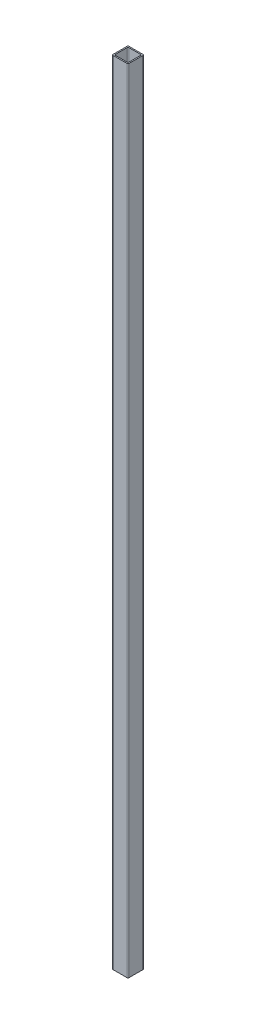
ISO-10303-21;
HEADER;
FILE_DESCRIPTION(('STEP AP214'),'2;1');
FILE_NAME('part.step','',(''),(''),'','','');
FILE_SCHEMA(('AUTOMOTIVE_DESIGN { 1 0 10303 214 1 1 1 1 }'));
ENDSEC;
DATA;
#1=APPLICATION_CONTEXT('core data for automotive mechanical design processes');
#2=APPLICATION_PROTOCOL_DEFINITION('international standard','automotive_design',2000,#1);
#3=PRODUCT_CONTEXT('',#1,'mechanical');
#4=PRODUCT('Part','Part','',(#3));
#5=PRODUCT_RELATED_PRODUCT_CATEGORY('part','',(#4));
#6=PRODUCT_DEFINITION_FORMATION('','',#4);
#7=PRODUCT_DEFINITION_CONTEXT('part definition',#1,'design');
#8=PRODUCT_DEFINITION('design','',#6,#7);
#9=PRODUCT_DEFINITION_SHAPE('','',#8);
#10=(LENGTH_UNIT() NAMED_UNIT(*) SI_UNIT(.MILLI.,.METRE.));
#11=(NAMED_UNIT(*) PLANE_ANGLE_UNIT() SI_UNIT($,.RADIAN.));
#12=(NAMED_UNIT(*) SI_UNIT($,.STERADIAN.) SOLID_ANGLE_UNIT());
#13=UNCERTAINTY_MEASURE_WITH_UNIT(LENGTH_MEASURE(1.E-05),#10,'distance_accuracy_value','');
#14=(GEOMETRIC_REPRESENTATION_CONTEXT(3) GLOBAL_UNCERTAINTY_ASSIGNED_CONTEXT((#13)) GLOBAL_UNIT_ASSIGNED_CONTEXT((#10,
#11,#12)) REPRESENTATION_CONTEXT('',''));
#15=CARTESIAN_POINT('',(0.,0.,0.));
#16=DIRECTION('',(0.,0.,1.));
#17=DIRECTION('',(1.,0.,0.));
#18=AXIS2_PLACEMENT_3D('',#15,#16,#17);
#19=CARTESIAN_POINT('',(-9.,1000.,9.));
#20=DIRECTION('',(0.,-1.,0.));
#21=DIRECTION('',(0.,0.,-1.));
#22=AXIS2_PLACEMENT_3D('',#19,#20,#21);
#23=PLANE('',#22);
#24=CARTESIAN_POINT('',(-9.,1000.,9.));
#25=DIRECTION('',(0.,1.,0.));
#26=DIRECTION('',(0.,0.,-1.));
#27=AXIS2_PLACEMENT_3D('',#24,#25,#26);
#28=CIRCLE('',#27,0.999999999999999);
#29=CARTESIAN_POINT('',(-10.,1000.,8.99999999999999));
#30=VERTEX_POINT('',#29);
#31=CARTESIAN_POINT('',(-8.99999999999999,1000.,10.));
#32=VERTEX_POINT('',#31);
#33=EDGE_CURVE('E216',#30,#32,#28,.T.);
#34=ORIENTED_EDGE('',*,*,#33,.T.);
#35=DIRECTION('',(1.,0.,0.));
#36=VECTOR('',#35,1.);
#37=CARTESIAN_POINT('',(-8.99999999999999,1000.,10.));
#38=LINE('',#37,#36);
#39=CARTESIAN_POINT('',(8.99999999999999,1000.,10.));
#40=VERTEX_POINT('',#39);
#41=EDGE_CURVE('E219',#32,#40,#38,.T.);
#42=ORIENTED_EDGE('',*,*,#41,.T.);
#43=CARTESIAN_POINT('',(9.,1000.,9.));
#44=DIRECTION('',(0.,1.,0.));
#45=DIRECTION('',(0.,0.,1.));
#46=AXIS2_PLACEMENT_3D('',#43,#44,#45);
#47=CIRCLE('',#46,0.999999999999999);
#48=CARTESIAN_POINT('',(10.,1000.,8.99999999999999));
#49=VERTEX_POINT('',#48);
#50=EDGE_CURVE('E222',#40,#49,#47,.T.);
#51=ORIENTED_EDGE('',*,*,#50,.T.);
#52=DIRECTION('',(0.,0.,-1.));
#53=VECTOR('',#52,1.);
#54=CARTESIAN_POINT('',(10.,1000.,8.99999999999999));
#55=LINE('',#54,#53);
#56=CARTESIAN_POINT('',(10.,1000.,-8.99999999999999));
#57=VERTEX_POINT('',#56);
#58=EDGE_CURVE('E224',#49,#57,#55,.T.);
#59=ORIENTED_EDGE('',*,*,#58,.T.);
#60=CARTESIAN_POINT('',(9.,1000.,-9.));
#61=DIRECTION('',(0.,1.,0.));
#62=DIRECTION('',(0.,0.,-1.));
#63=AXIS2_PLACEMENT_3D('',#60,#61,#62);
#64=CIRCLE('',#63,0.999999999999999);
#65=CARTESIAN_POINT('',(8.99999999999999,1000.,-10.));
#66=VERTEX_POINT('',#65);
#67=EDGE_CURVE('E226',#57,#66,#64,.T.);
#68=ORIENTED_EDGE('',*,*,#67,.T.);
#69=DIRECTION('',(-1.,0.,0.));
#70=VECTOR('',#69,1.);
#71=CARTESIAN_POINT('',(-8.99999999999999,1000.,-10.));
#72=LINE('',#71,#70);
#73=CARTESIAN_POINT('',(-8.99999999999999,1000.,-10.));
#74=VERTEX_POINT('',#73);
#75=EDGE_CURVE('E228',#66,#74,#72,.T.);
#76=ORIENTED_EDGE('',*,*,#75,.T.);
#77=CARTESIAN_POINT('',(-9.,1000.,-9.));
#78=DIRECTION('',(0.,1.,0.));
#79=DIRECTION('',(0.,0.,-1.));
#80=AXIS2_PLACEMENT_3D('',#77,#78,#79);
#81=CIRCLE('',#80,0.999999999999999);
#82=CARTESIAN_POINT('',(-10.,1000.,-8.99999999999999));
#83=VERTEX_POINT('',#82);
#84=EDGE_CURVE('E230',#74,#83,#81,.T.);
#85=ORIENTED_EDGE('',*,*,#84,.T.);
#86=DIRECTION('',(0.,0.,1.));
#87=VECTOR('',#86,1.);
#88=CARTESIAN_POINT('',(-10.,1000.,8.99999999999999));
#89=LINE('',#88,#87);
#90=EDGE_CURVE('E232',#83,#30,#89,.T.);
#91=ORIENTED_EDGE('',*,*,#90,.T.);
#92=EDGE_LOOP('',(#34,#42,#51,#59,#68,#76,#85,#91));
#93=FACE_BOUND('',#92,.T.);
#94=CARTESIAN_POINT('',(-7.5,1000.,7.5));
#95=DIRECTION('',(0.,1.,0.));
#96=DIRECTION('',(0.,0.,-1.));
#97=AXIS2_PLACEMENT_3D('',#94,#95,#96);
#98=CIRCLE('',#97,1.);
#99=CARTESIAN_POINT('',(-8.5,1000.,7.49999999999999));
#100=VERTEX_POINT('',#99);
#101=CARTESIAN_POINT('',(-7.5,1000.,8.5));
#102=VERTEX_POINT('',#101);
#103=EDGE_CURVE('E151',#100,#102,#98,.T.);
#104=ORIENTED_EDGE('',*,*,#103,.F.);
#105=DIRECTION('',(0.,0.,1.));
#106=VECTOR('',#105,1.);
#107=CARTESIAN_POINT('',(-8.5,1000.,7.49999999999999));
#108=LINE('',#107,#106);
#109=CARTESIAN_POINT('',(-8.5,1000.,-7.49999999999999));
#110=VERTEX_POINT('',#109);
#111=EDGE_CURVE('E184',#110,#100,#108,.T.);
#112=ORIENTED_EDGE('',*,*,#111,.F.);
#113=CARTESIAN_POINT('',(-7.5,1000.,-7.5));
#114=DIRECTION('',(0.,1.,0.));
#115=DIRECTION('',(0.,0.,-1.));
#116=AXIS2_PLACEMENT_3D('',#113,#114,#115);
#117=CIRCLE('',#116,1.);
#118=CARTESIAN_POINT('',(-7.5,1000.,-8.5));
#119=VERTEX_POINT('',#118);
#120=EDGE_CURVE('E182',#119,#110,#117,.T.);
#121=ORIENTED_EDGE('',*,*,#120,.F.);
#122=DIRECTION('',(-1.,0.,0.));
#123=VECTOR('',#122,1.);
#124=CARTESIAN_POINT('',(-7.5,1000.,-8.5));
#125=LINE('',#124,#123);
#126=CARTESIAN_POINT('',(7.49999999999999,1000.,-8.5));
#127=VERTEX_POINT('',#126);
#128=EDGE_CURVE('E180',#127,#119,#125,.T.);
#129=ORIENTED_EDGE('',*,*,#128,.F.);
#130=CARTESIAN_POINT('',(7.5,1000.,-7.5));
#131=DIRECTION('',(0.,1.,0.));
#132=DIRECTION('',(0.,0.,-1.));
#133=AXIS2_PLACEMENT_3D('',#130,#131,#132);
#134=CIRCLE('',#133,1.);
#135=CARTESIAN_POINT('',(8.5,1000.,-7.49999999999999));
#136=VERTEX_POINT('',#135);
#137=EDGE_CURVE('E178',#136,#127,#134,.T.);
#138=ORIENTED_EDGE('',*,*,#137,.F.);
#139=DIRECTION('',(0.,0.,-1.));
#140=VECTOR('',#139,1.);
#141=CARTESIAN_POINT('',(8.5,1000.,7.49999999999999));
#142=LINE('',#141,#140);
#143=CARTESIAN_POINT('',(8.5,1000.,7.49999999999999));
#144=VERTEX_POINT('',#143);
#145=EDGE_CURVE('E174',#144,#136,#142,.T.);
#146=ORIENTED_EDGE('',*,*,#145,.F.);
#147=CARTESIAN_POINT('',(7.5,1000.,7.5));
#148=DIRECTION('',(0.,1.,0.));
#149=DIRECTION('',(0.,0.,1.));
#150=AXIS2_PLACEMENT_3D('',#147,#148,#149);
#151=CIRCLE('',#150,1.);
#152=CARTESIAN_POINT('',(7.49999999999999,1000.,8.5));
#153=VERTEX_POINT('',#152);
#154=EDGE_CURVE('E172',#153,#144,#151,.T.);
#155=ORIENTED_EDGE('',*,*,#154,.F.);
#156=DIRECTION('',(1.,0.,0.));
#157=VECTOR('',#156,1.);
#158=CARTESIAN_POINT('',(-7.5,1000.,8.5));
#159=LINE('',#158,#157);
#160=EDGE_CURVE('E159',#102,#153,#159,.T.);
#161=ORIENTED_EDGE('',*,*,#160,.F.);
#162=EDGE_LOOP('',(#104,#112,#121,#129,#138,#146,#155,#161));
#163=FACE_BOUND('',#162,.T.);
#164=ADVANCED_FACE('F38',(#93,#163),#23,.F.);
#165=CARTESIAN_POINT('',(-9.,0.,9.));
#166=DIRECTION('',(0.,-1.,0.));
#167=DIRECTION('',(0.,0.,-1.));
#168=AXIS2_PLACEMENT_3D('',#165,#166,#167);
#169=PLANE('',#168);
#170=CARTESIAN_POINT('',(-9.,0.,9.));
#171=DIRECTION('',(0.,1.,0.));
#172=DIRECTION('',(0.,0.,-1.));
#173=AXIS2_PLACEMENT_3D('',#170,#171,#172);
#174=CIRCLE('',#173,0.999999999999999);
#175=CARTESIAN_POINT('',(-10.,0.,8.99999999999999));
#176=VERTEX_POINT('',#175);
#177=CARTESIAN_POINT('',(-8.99999999999999,0.,10.));
#178=VERTEX_POINT('',#177);
#179=EDGE_CURVE('E167',#176,#178,#174,.T.);
#180=ORIENTED_EDGE('',*,*,#179,.F.);
#181=DIRECTION('',(0.,0.,1.));
#182=VECTOR('',#181,1.);
#183=CARTESIAN_POINT('',(-10.,0.,8.99999999999999));
#184=LINE('',#183,#182);
#185=CARTESIAN_POINT('',(-10.,0.,-8.99999999999999));
#186=VERTEX_POINT('',#185);
#187=EDGE_CURVE('E220',#186,#176,#184,.T.);
#188=ORIENTED_EDGE('',*,*,#187,.F.);
#189=CARTESIAN_POINT('',(-9.,0.,-9.));
#190=DIRECTION('',(0.,1.,0.));
#191=DIRECTION('',(0.,0.,-1.));
#192=AXIS2_PLACEMENT_3D('',#189,#190,#191);
#193=CIRCLE('',#192,0.999999999999999);
#194=CARTESIAN_POINT('',(-8.99999999999999,0.,-10.));
#195=VERTEX_POINT('',#194);
#196=EDGE_CURVE('E247',#195,#186,#193,.T.);
#197=ORIENTED_EDGE('',*,*,#196,.F.);
#198=DIRECTION('',(-1.,0.,0.));
#199=VECTOR('',#198,1.);
#200=CARTESIAN_POINT('',(-8.99999999999999,0.,-10.));
#201=LINE('',#200,#199);
#202=CARTESIAN_POINT('',(8.99999999999999,0.,-10.));
#203=VERTEX_POINT('',#202);
#204=EDGE_CURVE('E245',#203,#195,#201,.T.);
#205=ORIENTED_EDGE('',*,*,#204,.F.);
#206=CARTESIAN_POINT('',(9.,0.,-9.));
#207=DIRECTION('',(0.,1.,0.));
#208=DIRECTION('',(0.,0.,-1.));
#209=AXIS2_PLACEMENT_3D('',#206,#207,#208);
#210=CIRCLE('',#209,0.999999999999999);
#211=CARTESIAN_POINT('',(10.,0.,-8.99999999999999));
#212=VERTEX_POINT('',#211);
#213=EDGE_CURVE('E243',#212,#203,#210,.T.);
#214=ORIENTED_EDGE('',*,*,#213,.F.);
#215=DIRECTION('',(0.,0.,-1.));
#216=VECTOR('',#215,1.);
#217=CARTESIAN_POINT('',(10.,0.,8.99999999999999));
#218=LINE('',#217,#216);
#219=CARTESIAN_POINT('',(10.,0.,8.99999999999999));
#220=VERTEX_POINT('',#219);
#221=EDGE_CURVE('E241',#220,#212,#218,.T.);
#222=ORIENTED_EDGE('',*,*,#221,.F.);
#223=CARTESIAN_POINT('',(9.,0.,9.));
#224=DIRECTION('',(0.,1.,0.));
#225=DIRECTION('',(0.,0.,1.));
#226=AXIS2_PLACEMENT_3D('',#223,#224,#225);
#227=CIRCLE('',#226,0.999999999999999);
#228=CARTESIAN_POINT('',(8.99999999999999,0.,10.));
#229=VERTEX_POINT('',#228);
#230=EDGE_CURVE('E239',#229,#220,#227,.T.);
#231=ORIENTED_EDGE('',*,*,#230,.F.);
#232=DIRECTION('',(1.,0.,0.));
#233=VECTOR('',#232,1.);
#234=CARTESIAN_POINT('',(-8.99999999999999,0.,10.));
#235=LINE('',#234,#233);
#236=EDGE_CURVE('E237',#178,#229,#235,.T.);
#237=ORIENTED_EDGE('',*,*,#236,.F.);
#238=EDGE_LOOP('',(#180,#188,#197,#205,#214,#222,#231,#237));
#239=FACE_BOUND('',#238,.T.);
#240=DIRECTION('',(0.,0.,1.));
#241=VECTOR('',#240,1.);
#242=CARTESIAN_POINT('',(-8.5,0.,7.49999999999999));
#243=LINE('',#242,#241);
#244=CARTESIAN_POINT('',(-8.5,0.,-7.49999999999999));
#245=VERTEX_POINT('',#244);
#246=CARTESIAN_POINT('',(-8.5,0.,7.49999999999999));
#247=VERTEX_POINT('',#246);
#248=EDGE_CURVE('E160',#245,#247,#243,.T.);
#249=ORIENTED_EDGE('',*,*,#248,.T.);
#250=CARTESIAN_POINT('',(-7.5,0.,7.5));
#251=DIRECTION('',(0.,1.,0.));
#252=DIRECTION('',(0.,0.,-1.));
#253=AXIS2_PLACEMENT_3D('',#250,#251,#252);
#254=CIRCLE('',#253,1.);
#255=CARTESIAN_POINT('',(-7.5,0.,8.5));
#256=VERTEX_POINT('',#255);
#257=EDGE_CURVE('E61',#247,#256,#254,.T.);
#258=ORIENTED_EDGE('',*,*,#257,.T.);
#259=DIRECTION('',(1.,0.,0.));
#260=VECTOR('',#259,1.);
#261=CARTESIAN_POINT('',(-7.5,0.,8.5));
#262=LINE('',#261,#260);
#263=CARTESIAN_POINT('',(7.49999999999999,0.,8.5));
#264=VERTEX_POINT('',#263);
#265=EDGE_CURVE('E166',#256,#264,#262,.T.);
#266=ORIENTED_EDGE('',*,*,#265,.T.);
#267=CARTESIAN_POINT('',(7.5,0.,7.5));
#268=DIRECTION('',(0.,1.,0.));
#269=DIRECTION('',(0.,0.,1.));
#270=AXIS2_PLACEMENT_3D('',#267,#268,#269);
#271=CIRCLE('',#270,1.);
#272=CARTESIAN_POINT('',(8.5,0.,7.49999999999999));
#273=VERTEX_POINT('',#272);
#274=EDGE_CURVE('E188',#264,#273,#271,.T.);
#275=ORIENTED_EDGE('',*,*,#274,.T.);
#276=DIRECTION('',(0.,0.,-1.));
#277=VECTOR('',#276,1.);
#278=CARTESIAN_POINT('',(8.5,0.,7.49999999999999));
#279=LINE('',#278,#277);
#280=CARTESIAN_POINT('',(8.5,0.,-7.49999999999999));
#281=VERTEX_POINT('',#280);
#282=EDGE_CURVE('E191',#273,#281,#279,.T.);
#283=ORIENTED_EDGE('',*,*,#282,.T.);
#284=CARTESIAN_POINT('',(7.5,0.,-7.5));
#285=DIRECTION('',(0.,1.,0.));
#286=DIRECTION('',(0.,0.,-1.));
#287=AXIS2_PLACEMENT_3D('',#284,#285,#286);
#288=CIRCLE('',#287,1.);
#289=CARTESIAN_POINT('',(7.49999999999999,0.,-8.5));
#290=VERTEX_POINT('',#289);
#291=EDGE_CURVE('E194',#281,#290,#288,.T.);
#292=ORIENTED_EDGE('',*,*,#291,.T.);
#293=DIRECTION('',(-1.,0.,0.));
#294=VECTOR('',#293,1.);
#295=CARTESIAN_POINT('',(-7.5,0.,-8.5));
#296=LINE('',#295,#294);
#297=CARTESIAN_POINT('',(-7.5,0.,-8.5));
#298=VERTEX_POINT('',#297);
#299=EDGE_CURVE('E197',#290,#298,#296,.T.);
#300=ORIENTED_EDGE('',*,*,#299,.T.);
#301=CARTESIAN_POINT('',(-7.5,0.,-7.5));
#302=DIRECTION('',(0.,1.,0.));
#303=DIRECTION('',(0.,0.,-1.));
#304=AXIS2_PLACEMENT_3D('',#301,#302,#303);
#305=CIRCLE('',#304,1.);
#306=EDGE_CURVE('E200',#298,#245,#305,.T.);
#307=ORIENTED_EDGE('',*,*,#306,.T.);
#308=EDGE_LOOP('',(#249,#258,#266,#275,#283,#292,#300,#307));
#309=FACE_BOUND('',#308,.T.);
#310=ADVANCED_FACE('F277',(#239,#309),#169,.T.);
#311=CARTESIAN_POINT('',(-9.,1000.,9.));
#312=DIRECTION('',(0.,-1.,0.));
#313=DIRECTION('',(0.,0.,-1.));
#314=AXIS2_PLACEMENT_3D('',#311,#312,#313);
#315=CYLINDRICAL_SURFACE('',#314,0.999999999999999);
#316=ORIENTED_EDGE('',*,*,#179,.T.);
#317=DIRECTION('',(0.,-1.,0.));
#318=VECTOR('',#317,1.);
#319=CARTESIAN_POINT('',(-8.99999999999999,1000.,10.));
#320=LINE('',#319,#318);
#321=EDGE_CURVE('E11',#32,#178,#320,.T.);
#322=ORIENTED_EDGE('',*,*,#321,.F.);
#323=ORIENTED_EDGE('',*,*,#33,.F.);
#324=DIRECTION('',(0.,-1.,0.));
#325=VECTOR('',#324,1.);
#326=CARTESIAN_POINT('',(-10.,1000.,8.99999999999999));
#327=LINE('',#326,#325);
#328=EDGE_CURVE('E234',#30,#176,#327,.T.);
#329=ORIENTED_EDGE('',*,*,#328,.T.);
#330=EDGE_LOOP('',(#316,#322,#323,#329));
#331=FACE_BOUND('',#330,.T.);
#332=ADVANCED_FACE('F40',(#331),#315,.T.);
#333=CARTESIAN_POINT('',(-8.99999999999999,1000.,10.));
#334=DIRECTION('',(0.,0.,-1.));
#335=DIRECTION('',(-1.,0.,0.));
#336=AXIS2_PLACEMENT_3D('',#333,#334,#335);
#337=PLANE('',#336);
#338=ORIENTED_EDGE('',*,*,#236,.T.);
#339=DIRECTION('',(0.,-1.,0.));
#340=VECTOR('',#339,1.);
#341=CARTESIAN_POINT('',(8.99999999999999,1000.,10.));
#342=LINE('',#341,#340);
#343=EDGE_CURVE('E46',#40,#229,#342,.T.);
#344=ORIENTED_EDGE('',*,*,#343,.F.);
#345=ORIENTED_EDGE('',*,*,#41,.F.);
#346=ORIENTED_EDGE('',*,*,#321,.T.);
#347=EDGE_LOOP('',(#338,#344,#345,#346));
#348=FACE_BOUND('',#347,.T.);
#349=ADVANCED_FACE('F294',(#348),#337,.F.);
#350=CARTESIAN_POINT('',(9.,1000.,9.));
#351=DIRECTION('',(0.,-1.,0.));
#352=DIRECTION('',(0.,0.,-1.));
#353=AXIS2_PLACEMENT_3D('',#350,#351,#352);
#354=CYLINDRICAL_SURFACE('',#353,0.999999999999999);
#355=ORIENTED_EDGE('',*,*,#230,.T.);
#356=DIRECTION('',(0.,-1.,0.));
#357=VECTOR('',#356,1.);
#358=CARTESIAN_POINT('',(10.,1000.,8.99999999999999));
#359=LINE('',#358,#357);
#360=EDGE_CURVE('E264',#49,#220,#359,.T.);
#361=ORIENTED_EDGE('',*,*,#360,.F.);
#362=ORIENTED_EDGE('',*,*,#50,.F.);
#363=ORIENTED_EDGE('',*,*,#343,.T.);
#364=EDGE_LOOP('',(#355,#361,#362,#363));
#365=FACE_BOUND('',#364,.T.);
#366=ADVANCED_FACE('F271',(#365),#354,.T.);
#367=CARTESIAN_POINT('',(10.,1000.,8.99999999999999));
#368=DIRECTION('',(-1.,0.,0.));
#369=DIRECTION('',(0.,0.,1.));
#370=AXIS2_PLACEMENT_3D('',#367,#368,#369);
#371=PLANE('',#370);
#372=ORIENTED_EDGE('',*,*,#221,.T.);
#373=DIRECTION('',(0.,-1.,0.));
#374=VECTOR('',#373,1.);
#375=CARTESIAN_POINT('',(10.,1000.,-8.99999999999999));
#376=LINE('',#375,#374);
#377=EDGE_CURVE('E261',#57,#212,#376,.T.);
#378=ORIENTED_EDGE('',*,*,#377,.F.);
#379=ORIENTED_EDGE('',*,*,#58,.F.);
#380=ORIENTED_EDGE('',*,*,#360,.T.);
#381=EDGE_LOOP('',(#372,#378,#379,#380));
#382=FACE_BOUND('',#381,.T.);
#383=ADVANCED_FACE('F283',(#382),#371,.F.);
#384=CARTESIAN_POINT('',(9.,1000.,-9.));
#385=DIRECTION('',(0.,-1.,0.));
#386=DIRECTION('',(0.,0.,-1.));
#387=AXIS2_PLACEMENT_3D('',#384,#385,#386);
#388=CYLINDRICAL_SURFACE('',#387,0.999999999999999);
#389=ORIENTED_EDGE('',*,*,#213,.T.);
#390=DIRECTION('',(0.,-1.,0.));
#391=VECTOR('',#390,1.);
#392=CARTESIAN_POINT('',(8.99999999999999,1000.,-10.));
#393=LINE('',#392,#391);
#394=EDGE_CURVE('E258',#66,#203,#393,.T.);
#395=ORIENTED_EDGE('',*,*,#394,.F.);
#396=ORIENTED_EDGE('',*,*,#67,.F.);
#397=ORIENTED_EDGE('',*,*,#377,.T.);
#398=EDGE_LOOP('',(#389,#395,#396,#397));
#399=FACE_BOUND('',#398,.T.);
#400=ADVANCED_FACE('F287',(#399),#388,.T.);
#401=CARTESIAN_POINT('',(-8.99999999999999,1000.,-10.));
#402=DIRECTION('',(0.,0.,1.));
#403=DIRECTION('',(1.,0.,0.));
#404=AXIS2_PLACEMENT_3D('',#401,#402,#403);
#405=PLANE('',#404);
#406=ORIENTED_EDGE('',*,*,#204,.T.);
#407=DIRECTION('',(0.,-1.,0.));
#408=VECTOR('',#407,1.);
#409=CARTESIAN_POINT('',(-8.99999999999999,1000.,-10.));
#410=LINE('',#409,#408);
#411=EDGE_CURVE('E255',#74,#195,#410,.T.);
#412=ORIENTED_EDGE('',*,*,#411,.F.);
#413=ORIENTED_EDGE('',*,*,#75,.F.);
#414=ORIENTED_EDGE('',*,*,#394,.T.);
#415=EDGE_LOOP('',(#406,#412,#413,#414));
#416=FACE_BOUND('',#415,.T.);
#417=ADVANCED_FACE('F307',(#416),#405,.F.);
#418=CARTESIAN_POINT('',(-9.,1000.,-9.));
#419=DIRECTION('',(0.,-1.,0.));
#420=DIRECTION('',(0.,0.,-1.));
#421=AXIS2_PLACEMENT_3D('',#418,#419,#420);
#422=CYLINDRICAL_SURFACE('',#421,0.999999999999999);
#423=ORIENTED_EDGE('',*,*,#196,.T.);
#424=DIRECTION('',(0.,-1.,0.));
#425=VECTOR('',#424,1.);
#426=CARTESIAN_POINT('',(-10.,1000.,-8.99999999999999));
#427=LINE('',#426,#425);
#428=EDGE_CURVE('E252',#83,#186,#427,.T.);
#429=ORIENTED_EDGE('',*,*,#428,.F.);
#430=ORIENTED_EDGE('',*,*,#84,.F.);
#431=ORIENTED_EDGE('',*,*,#411,.T.);
#432=EDGE_LOOP('',(#423,#429,#430,#431));
#433=FACE_BOUND('',#432,.T.);
#434=ADVANCED_FACE('F305',(#433),#422,.T.);
#435=CARTESIAN_POINT('',(-10.,1000.,8.99999999999999));
#436=DIRECTION('',(1.,0.,0.));
#437=DIRECTION('',(0.,0.,-1.));
#438=AXIS2_PLACEMENT_3D('',#435,#436,#437);
#439=PLANE('',#438);
#440=ORIENTED_EDGE('',*,*,#187,.T.);
#441=ORIENTED_EDGE('',*,*,#328,.F.);
#442=ORIENTED_EDGE('',*,*,#90,.F.);
#443=ORIENTED_EDGE('',*,*,#428,.T.);
#444=EDGE_LOOP('',(#440,#441,#442,#443));
#445=FACE_BOUND('',#444,.T.);
#446=ADVANCED_FACE('F300',(#445),#439,.F.);
#447=CARTESIAN_POINT('',(-7.5,1000.,7.5));
#448=DIRECTION('',(0.,-1.,0.));
#449=DIRECTION('',(0.,0.,-1.));
#450=AXIS2_PLACEMENT_3D('',#447,#448,#449);
#451=CYLINDRICAL_SURFACE('',#450,1.);
#452=ORIENTED_EDGE('',*,*,#257,.F.);
#453=DIRECTION('',(0.,-1.,0.));
#454=VECTOR('',#453,1.);
#455=CARTESIAN_POINT('',(-8.5,1000.,7.49999999999999));
#456=LINE('',#455,#454);
#457=EDGE_CURVE('E155',#100,#247,#456,.T.);
#458=ORIENTED_EDGE('',*,*,#457,.F.);
#459=ORIENTED_EDGE('',*,*,#103,.T.);
#460=DIRECTION('',(0.,-1.,0.));
#461=VECTOR('',#460,1.);
#462=CARTESIAN_POINT('',(-7.5,1000.,8.5));
#463=LINE('',#462,#461);
#464=EDGE_CURVE('E154',#102,#256,#463,.T.);
#465=ORIENTED_EDGE('',*,*,#464,.T.);
#466=EDGE_LOOP('',(#452,#458,#459,#465));
#467=FACE_BOUND('',#466,.T.);
#468=ADVANCED_FACE('F153',(#467),#451,.F.);
#469=CARTESIAN_POINT('',(-7.5,1000.,8.5));
#470=DIRECTION('',(0.,0.,-1.));
#471=DIRECTION('',(-1.,0.,0.));
#472=AXIS2_PLACEMENT_3D('',#469,#470,#471);
#473=PLANE('',#472);
#474=ORIENTED_EDGE('',*,*,#265,.F.);
#475=ORIENTED_EDGE('',*,*,#464,.F.);
#476=ORIENTED_EDGE('',*,*,#160,.T.);
#477=DIRECTION('',(0.,-1.,0.));
#478=VECTOR('',#477,1.);
#479=CARTESIAN_POINT('',(7.49999999999999,1000.,8.5));
#480=LINE('',#479,#478);
#481=EDGE_CURVE('E168',#153,#264,#480,.T.);
#482=ORIENTED_EDGE('',*,*,#481,.T.);
#483=EDGE_LOOP('',(#474,#475,#476,#482));
#484=FACE_BOUND('',#483,.T.);
#485=ADVANCED_FACE('F163',(#484),#473,.T.);
#486=CARTESIAN_POINT('',(7.5,1000.,7.5));
#487=DIRECTION('',(0.,-1.,0.));
#488=DIRECTION('',(0.,0.,-1.));
#489=AXIS2_PLACEMENT_3D('',#486,#487,#488);
#490=CYLINDRICAL_SURFACE('',#489,1.);
#491=ORIENTED_EDGE('',*,*,#274,.F.);
#492=ORIENTED_EDGE('',*,*,#481,.F.);
#493=ORIENTED_EDGE('',*,*,#154,.T.);
#494=DIRECTION('',(0.,-1.,0.));
#495=VECTOR('',#494,1.);
#496=CARTESIAN_POINT('',(8.5,1000.,7.49999999999999));
#497=LINE('',#496,#495);
#498=EDGE_CURVE('E213',#144,#273,#497,.T.);
#499=ORIENTED_EDGE('',*,*,#498,.T.);
#500=EDGE_LOOP('',(#491,#492,#493,#499));
#501=FACE_BOUND('',#500,.T.);
#502=ADVANCED_FACE('F332',(#501),#490,.F.);
#503=CARTESIAN_POINT('',(8.5,1000.,7.49999999999999));
#504=DIRECTION('',(-1.,0.,0.));
#505=DIRECTION('',(0.,0.,1.));
#506=AXIS2_PLACEMENT_3D('',#503,#504,#505);
#507=PLANE('',#506);
#508=ORIENTED_EDGE('',*,*,#282,.F.);
#509=ORIENTED_EDGE('',*,*,#498,.F.);
#510=ORIENTED_EDGE('',*,*,#145,.T.);
#511=DIRECTION('',(0.,-1.,0.));
#512=VECTOR('',#511,1.);
#513=CARTESIAN_POINT('',(8.5,1000.,-7.49999999999999));
#514=LINE('',#513,#512);
#515=EDGE_CURVE('E211',#136,#281,#514,.T.);
#516=ORIENTED_EDGE('',*,*,#515,.T.);
#517=EDGE_LOOP('',(#508,#509,#510,#516));
#518=FACE_BOUND('',#517,.T.);
#519=ADVANCED_FACE('F336',(#518),#507,.T.);
#520=CARTESIAN_POINT('',(7.5,1000.,-7.5));
#521=DIRECTION('',(0.,-1.,0.));
#522=DIRECTION('',(0.,0.,-1.));
#523=AXIS2_PLACEMENT_3D('',#520,#521,#522);
#524=CYLINDRICAL_SURFACE('',#523,1.);
#525=ORIENTED_EDGE('',*,*,#291,.F.);
#526=ORIENTED_EDGE('',*,*,#515,.F.);
#527=ORIENTED_EDGE('',*,*,#137,.T.);
#528=DIRECTION('',(0.,-1.,0.));
#529=VECTOR('',#528,1.);
#530=CARTESIAN_POINT('',(7.49999999999999,1000.,-8.5));
#531=LINE('',#530,#529);
#532=EDGE_CURVE('E209',#127,#290,#531,.T.);
#533=ORIENTED_EDGE('',*,*,#532,.T.);
#534=EDGE_LOOP('',(#525,#526,#527,#533));
#535=FACE_BOUND('',#534,.T.);
#536=ADVANCED_FACE('F342',(#535),#524,.F.);
#537=CARTESIAN_POINT('',(-7.5,1000.,-8.5));
#538=DIRECTION('',(0.,0.,1.));
#539=DIRECTION('',(1.,0.,0.));
#540=AXIS2_PLACEMENT_3D('',#537,#538,#539);
#541=PLANE('',#540);
#542=ORIENTED_EDGE('',*,*,#299,.F.);
#543=ORIENTED_EDGE('',*,*,#532,.F.);
#544=ORIENTED_EDGE('',*,*,#128,.T.);
#545=DIRECTION('',(0.,-1.,0.));
#546=VECTOR('',#545,1.);
#547=CARTESIAN_POINT('',(-7.5,1000.,-8.5));
#548=LINE('',#547,#546);
#549=EDGE_CURVE('E207',#119,#298,#548,.T.);
#550=ORIENTED_EDGE('',*,*,#549,.T.);
#551=EDGE_LOOP('',(#542,#543,#544,#550));
#552=FACE_BOUND('',#551,.T.);
#553=ADVANCED_FACE('F346',(#552),#541,.T.);
#554=CARTESIAN_POINT('',(-7.5,1000.,-7.5));
#555=DIRECTION('',(0.,-1.,0.));
#556=DIRECTION('',(0.,0.,-1.));
#557=AXIS2_PLACEMENT_3D('',#554,#555,#556);
#558=CYLINDRICAL_SURFACE('',#557,1.);
#559=ORIENTED_EDGE('',*,*,#306,.F.);
#560=ORIENTED_EDGE('',*,*,#549,.F.);
#561=ORIENTED_EDGE('',*,*,#120,.T.);
#562=DIRECTION('',(0.,-1.,0.));
#563=VECTOR('',#562,1.);
#564=CARTESIAN_POINT('',(-8.5,1000.,-7.49999999999999));
#565=LINE('',#564,#563);
#566=EDGE_CURVE('E53',#110,#245,#565,.T.);
#567=ORIENTED_EDGE('',*,*,#566,.T.);
#568=EDGE_LOOP('',(#559,#560,#561,#567));
#569=FACE_BOUND('',#568,.T.);
#570=ADVANCED_FACE('F350',(#569),#558,.F.);
#571=CARTESIAN_POINT('',(-8.5,1000.,7.49999999999999));
#572=DIRECTION('',(1.,0.,0.));
#573=DIRECTION('',(0.,0.,-1.));
#574=AXIS2_PLACEMENT_3D('',#571,#572,#573);
#575=PLANE('',#574);
#576=ORIENTED_EDGE('',*,*,#248,.F.);
#577=ORIENTED_EDGE('',*,*,#566,.F.);
#578=ORIENTED_EDGE('',*,*,#111,.T.);
#579=ORIENTED_EDGE('',*,*,#457,.T.);
#580=EDGE_LOOP('',(#576,#577,#578,#579));
#581=FACE_BOUND('',#580,.T.);
#582=ADVANCED_FACE('F354',(#581),#575,.T.);
#583=CLOSED_SHELL('',(#164,#310,#332,#349,#366,#383,#400,#417,#434,#446,#468,#485,#502,#519,
#536,#553,#570,#582));
#584=MANIFOLD_SOLID_BREP('B2',#583);
#585=ADVANCED_BREP_SHAPE_REPRESENTATION('',(#18,#584),#14);
#586=SHAPE_DEFINITION_REPRESENTATION(#9,#585);
ENDSEC;
END-ISO-10303-21;
